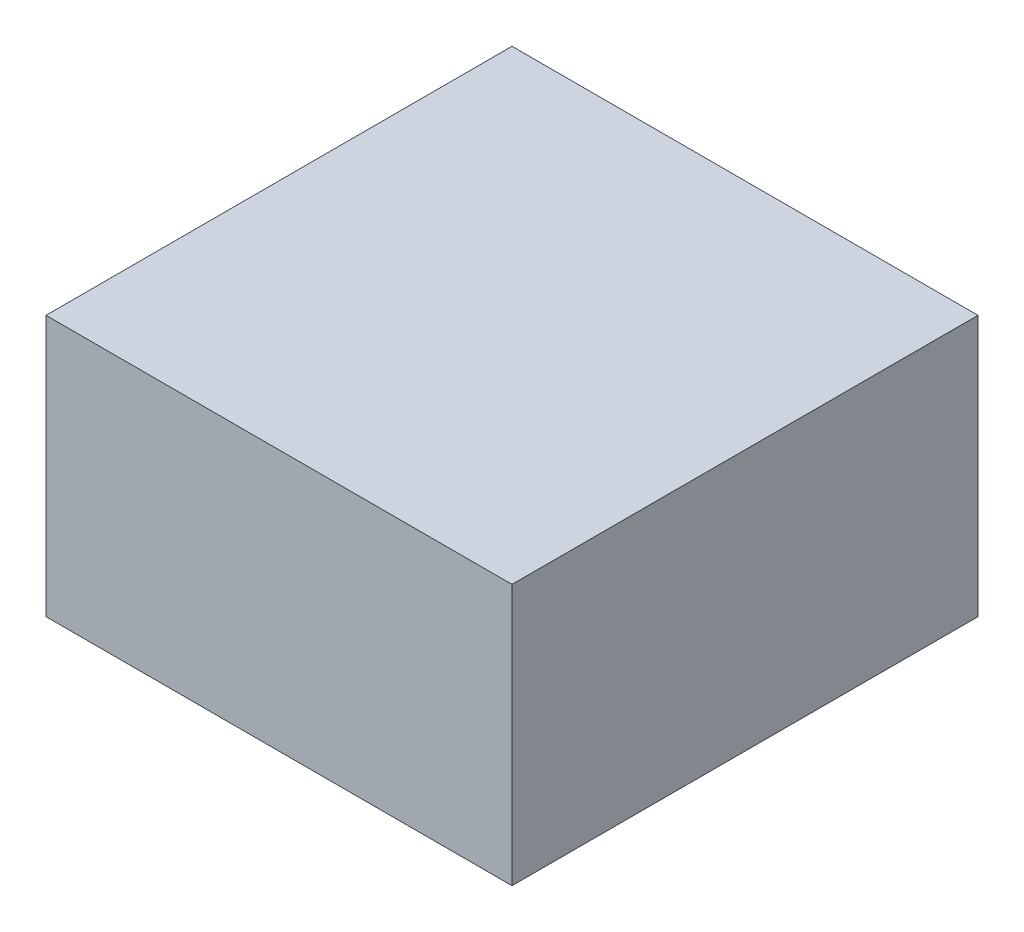
ISO-10303-21;
HEADER;
FILE_DESCRIPTION(('STEP AP214'),'2;1');
FILE_NAME('part.step','',(''),(''),'','','');
FILE_SCHEMA(('AUTOMOTIVE_DESIGN { 1 0 10303 214 1 1 1 1 }'));
ENDSEC;
DATA;
#1=APPLICATION_CONTEXT('core data for automotive mechanical design processes');
#2=APPLICATION_PROTOCOL_DEFINITION('international standard','automotive_design',2000,#1);
#3=PRODUCT_CONTEXT('',#1,'mechanical');
#4=PRODUCT('Part','Part','',(#3));
#5=PRODUCT_RELATED_PRODUCT_CATEGORY('part','',(#4));
#6=PRODUCT_DEFINITION_FORMATION('','',#4);
#7=PRODUCT_DEFINITION_CONTEXT('part definition',#1,'design');
#8=PRODUCT_DEFINITION('design','',#6,#7);
#9=PRODUCT_DEFINITION_SHAPE('','',#8);
#10=(LENGTH_UNIT() NAMED_UNIT(*) SI_UNIT(.MILLI.,.METRE.));
#11=(NAMED_UNIT(*) PLANE_ANGLE_UNIT() SI_UNIT($,.RADIAN.));
#12=(NAMED_UNIT(*) SI_UNIT($,.STERADIAN.) SOLID_ANGLE_UNIT());
#13=UNCERTAINTY_MEASURE_WITH_UNIT(LENGTH_MEASURE(1.E-05),#10,'distance_accuracy_value','');
#14=(GEOMETRIC_REPRESENTATION_CONTEXT(3) GLOBAL_UNCERTAINTY_ASSIGNED_CONTEXT((#13)) GLOBAL_UNIT_ASSIGNED_CONTEXT((#10,
#11,#12)) REPRESENTATION_CONTEXT('',''));
#15=CARTESIAN_POINT('',(0.,0.,0.));
#16=DIRECTION('',(0.,0.,1.));
#17=DIRECTION('',(1.,0.,0.));
#18=AXIS2_PLACEMENT_3D('',#15,#16,#17);
#19=CARTESIAN_POINT('',(0.,0.14,0.));
#20=DIRECTION('',(0.,1.,0.));
#21=DIRECTION('',(1.,0.,0.));
#22=AXIS2_PLACEMENT_3D('',#19,#20,#21);
#23=PLANE('',#22);
#24=DIRECTION('',(1.,0.,0.));
#25=VECTOR('',#24,1.);
#26=CARTESIAN_POINT('',(-0.125,0.14,0.25));
#27=LINE('',#26,#25);
#28=CARTESIAN_POINT('',(-0.125,0.14,0.25));
#29=VERTEX_POINT('',#28);
#30=CARTESIAN_POINT('',(0.125,0.14,0.25));
#31=VERTEX_POINT('',#30);
#32=EDGE_CURVE('E11',#29,#31,#27,.T.);
#33=ORIENTED_EDGE('',*,*,#32,.T.);
#34=DIRECTION('',(0.,0.,-1.));
#35=VECTOR('',#34,1.);
#36=CARTESIAN_POINT('',(0.125,0.14,0.25));
#37=LINE('',#36,#35);
#38=CARTESIAN_POINT('',(0.125,0.14,0.));
#39=VERTEX_POINT('',#38);
#40=EDGE_CURVE('E43',#31,#39,#37,.T.);
#41=ORIENTED_EDGE('',*,*,#40,.T.);
#42=DIRECTION('',(-1.,0.,0.));
#43=VECTOR('',#42,1.);
#44=CARTESIAN_POINT('',(0.125,0.14,0.));
#45=LINE('',#44,#43);
#46=CARTESIAN_POINT('',(-0.125,0.14,0.));
#47=VERTEX_POINT('',#46);
#48=EDGE_CURVE('E82',#39,#47,#45,.T.);
#49=ORIENTED_EDGE('',*,*,#48,.T.);
#50=DIRECTION('',(0.,0.,1.));
#51=VECTOR('',#50,1.);
#52=CARTESIAN_POINT('',(-0.125,0.14,0.));
#53=LINE('',#52,#51);
#54=EDGE_CURVE('E77',#47,#29,#53,.T.);
#55=ORIENTED_EDGE('',*,*,#54,.T.);
#56=EDGE_LOOP('',(#33,#41,#49,#55));
#57=FACE_BOUND('',#56,.T.);
#58=ADVANCED_FACE('F17',(#57),#23,.T.);
#59=CARTESIAN_POINT('',(-0.125,0.,0.25));
#60=DIRECTION('',(0.,0.,1.));
#61=DIRECTION('',(1.,0.,0.));
#62=AXIS2_PLACEMENT_3D('',#59,#60,#61);
#63=PLANE('',#62);
#64=DIRECTION('',(0.,1.,0.));
#65=VECTOR('',#64,1.);
#66=CARTESIAN_POINT('',(0.125,0.,0.25));
#67=LINE('',#66,#65);
#68=CARTESIAN_POINT('',(0.125,0.,0.25));
#69=VERTEX_POINT('',#68);
#70=EDGE_CURVE('E20',#69,#31,#67,.T.);
#71=ORIENTED_EDGE('',*,*,#70,.T.);
#72=ORIENTED_EDGE('',*,*,#32,.F.);
#73=DIRECTION('',(0.,1.,0.));
#74=VECTOR('',#73,1.);
#75=CARTESIAN_POINT('',(-0.125,0.,0.25));
#76=LINE('',#75,#74);
#77=CARTESIAN_POINT('',(-0.125,0.,0.25));
#78=VERTEX_POINT('',#77);
#79=EDGE_CURVE('E91',#78,#29,#76,.T.);
#80=ORIENTED_EDGE('',*,*,#79,.F.);
#81=DIRECTION('',(1.,0.,0.));
#82=VECTOR('',#81,1.);
#83=CARTESIAN_POINT('',(-0.125,0.,0.25));
#84=LINE('',#83,#82);
#85=EDGE_CURVE('E89',#78,#69,#84,.T.);
#86=ORIENTED_EDGE('',*,*,#85,.T.);
#87=EDGE_LOOP('',(#71,#72,#80,#86));
#88=FACE_BOUND('',#87,.T.);
#89=ADVANCED_FACE('F119',(#88),#63,.T.);
#90=CARTESIAN_POINT('',(0.125,0.,0.25));
#91=DIRECTION('',(1.,0.,0.));
#92=DIRECTION('',(0.,1.,0.));
#93=AXIS2_PLACEMENT_3D('',#90,#91,#92);
#94=PLANE('',#93);
#95=DIRECTION('',(0.,1.,0.));
#96=VECTOR('',#95,1.);
#97=CARTESIAN_POINT('',(0.125,0.,0.));
#98=LINE('',#97,#96);
#99=CARTESIAN_POINT('',(0.125,0.,0.));
#100=VERTEX_POINT('',#99);
#101=EDGE_CURVE('E94',#100,#39,#98,.T.);
#102=ORIENTED_EDGE('',*,*,#101,.T.);
#103=ORIENTED_EDGE('',*,*,#40,.F.);
#104=ORIENTED_EDGE('',*,*,#70,.F.);
#105=DIRECTION('',(0.,0.,-1.));
#106=VECTOR('',#105,1.);
#107=CARTESIAN_POINT('',(0.125,0.,0.25));
#108=LINE('',#107,#106);
#109=EDGE_CURVE('E97',#69,#100,#108,.T.);
#110=ORIENTED_EDGE('',*,*,#109,.T.);
#111=EDGE_LOOP('',(#102,#103,#104,#110));
#112=FACE_BOUND('',#111,.T.);
#113=ADVANCED_FACE('F122',(#112),#94,.T.);
#114=CARTESIAN_POINT('',(0.125,0.,0.));
#115=DIRECTION('',(0.,0.,-1.));
#116=DIRECTION('',(0.,-1.,0.));
#117=AXIS2_PLACEMENT_3D('',#114,#115,#116);
#118=PLANE('',#117);
#119=DIRECTION('',(0.,1.,0.));
#120=VECTOR('',#119,1.);
#121=CARTESIAN_POINT('',(-0.125,0.,0.));
#122=LINE('',#121,#120);
#123=CARTESIAN_POINT('',(-0.125,0.,0.));
#124=VERTEX_POINT('',#123);
#125=EDGE_CURVE('E71',#124,#47,#122,.T.);
#126=ORIENTED_EDGE('',*,*,#125,.T.);
#127=ORIENTED_EDGE('',*,*,#48,.F.);
#128=ORIENTED_EDGE('',*,*,#101,.F.);
#129=DIRECTION('',(-1.,0.,0.));
#130=VECTOR('',#129,1.);
#131=CARTESIAN_POINT('',(0.125,0.,0.));
#132=LINE('',#131,#130);
#133=EDGE_CURVE('E87',#100,#124,#132,.T.);
#134=ORIENTED_EDGE('',*,*,#133,.T.);
#135=EDGE_LOOP('',(#126,#127,#128,#134));
#136=FACE_BOUND('',#135,.T.);
#137=ADVANCED_FACE('F93',(#136),#118,.T.);
#138=CARTESIAN_POINT('',(-0.125,0.,0.));
#139=DIRECTION('',(-1.,0.,0.));
#140=DIRECTION('',(0.,0.,1.));
#141=AXIS2_PLACEMENT_3D('',#138,#139,#140);
#142=PLANE('',#141);
#143=ORIENTED_EDGE('',*,*,#79,.T.);
#144=ORIENTED_EDGE('',*,*,#54,.F.);
#145=ORIENTED_EDGE('',*,*,#125,.F.);
#146=DIRECTION('',(0.,0.,1.));
#147=VECTOR('',#146,1.);
#148=CARTESIAN_POINT('',(-0.125,0.,0.));
#149=LINE('',#148,#147);
#150=EDGE_CURVE('E75',#124,#78,#149,.T.);
#151=ORIENTED_EDGE('',*,*,#150,.T.);
#152=EDGE_LOOP('',(#143,#144,#145,#151));
#153=FACE_BOUND('',#152,.T.);
#154=ADVANCED_FACE('F74',(#153),#142,.T.);
#155=CARTESIAN_POINT('',(0.,0.,0.));
#156=DIRECTION('',(0.,1.,0.));
#157=DIRECTION('',(1.,0.,0.));
#158=AXIS2_PLACEMENT_3D('',#155,#156,#157);
#159=PLANE('',#158);
#160=ORIENTED_EDGE('',*,*,#133,.F.);
#161=ORIENTED_EDGE('',*,*,#109,.F.);
#162=ORIENTED_EDGE('',*,*,#85,.F.);
#163=ORIENTED_EDGE('',*,*,#150,.F.);
#164=EDGE_LOOP('',(#160,#161,#162,#163));
#165=FACE_BOUND('',#164,.T.);
#166=ADVANCED_FACE('F85',(#165),#159,.F.);
#167=CLOSED_SHELL('',(#58,#89,#113,#137,#154,#166));
#168=MANIFOLD_SOLID_BREP('B1',#167);
#169=ADVANCED_BREP_SHAPE_REPRESENTATION('',(#18,#168),#14);
#170=SHAPE_DEFINITION_REPRESENTATION(#9,#169);
ENDSEC;
END-ISO-10303-21;
